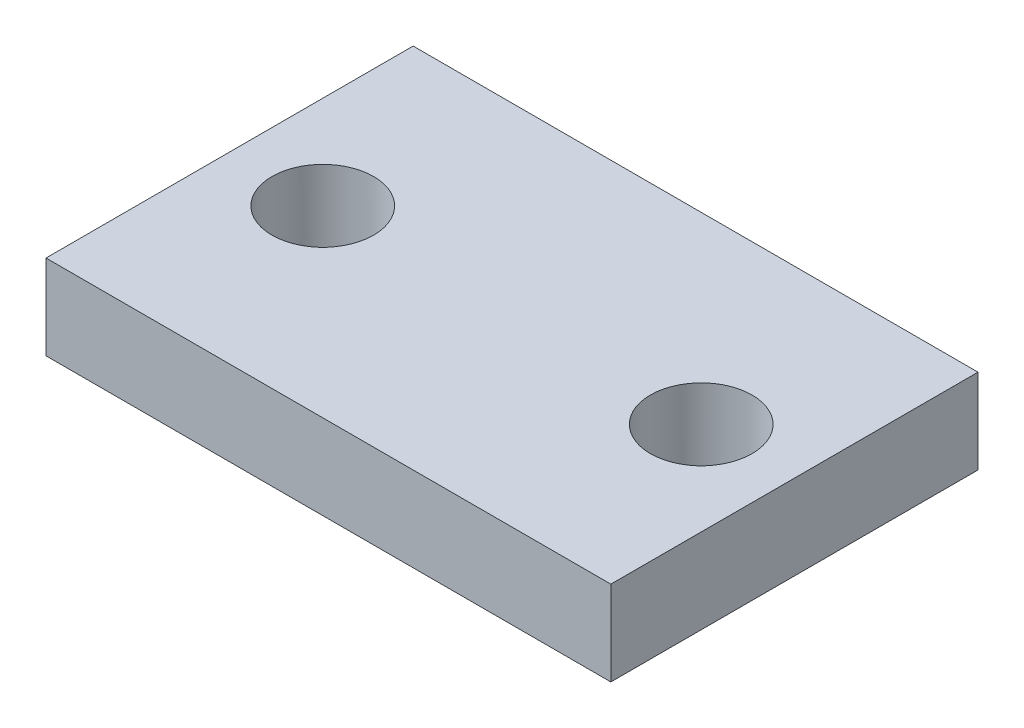
ISO-10303-21;
HEADER;
FILE_DESCRIPTION(('STEP AP214'),'2;1');
FILE_NAME('part.step','',(''),(''),'','','');
FILE_SCHEMA(('AUTOMOTIVE_DESIGN { 1 0 10303 214 1 1 1 1 }'));
ENDSEC;
DATA;
#1=APPLICATION_CONTEXT('core data for automotive mechanical design processes');
#2=APPLICATION_PROTOCOL_DEFINITION('international standard','automotive_design',2000,#1);
#3=PRODUCT_CONTEXT('',#1,'mechanical');
#4=PRODUCT('Part','Part','',(#3));
#5=PRODUCT_RELATED_PRODUCT_CATEGORY('part','',(#4));
#6=PRODUCT_DEFINITION_FORMATION('','',#4);
#7=PRODUCT_DEFINITION_CONTEXT('part definition',#1,'design');
#8=PRODUCT_DEFINITION('design','',#6,#7);
#9=PRODUCT_DEFINITION_SHAPE('','',#8);
#10=(LENGTH_UNIT() NAMED_UNIT(*) SI_UNIT(.MILLI.,.METRE.));
#11=(NAMED_UNIT(*) PLANE_ANGLE_UNIT() SI_UNIT($,.RADIAN.));
#12=(NAMED_UNIT(*) SI_UNIT($,.STERADIAN.) SOLID_ANGLE_UNIT());
#13=UNCERTAINTY_MEASURE_WITH_UNIT(LENGTH_MEASURE(1.E-05),#10,'distance_accuracy_value','');
#14=(GEOMETRIC_REPRESENTATION_CONTEXT(3) GLOBAL_UNCERTAINTY_ASSIGNED_CONTEXT((#13)) GLOBAL_UNIT_ASSIGNED_CONTEXT((#10,
#11,#12)) REPRESENTATION_CONTEXT('',''));
#15=CARTESIAN_POINT('',(0.,0.,0.));
#16=DIRECTION('',(0.,0.,1.));
#17=DIRECTION('',(1.,0.,0.));
#18=AXIS2_PLACEMENT_3D('',#15,#16,#17);
#19=CARTESIAN_POINT('',(0.,3.,0.));
#20=DIRECTION('',(1.,0.,0.));
#21=DIRECTION('',(0.,0.,-1.));
#22=AXIS2_PLACEMENT_3D('',#19,#20,#21);
#23=PLANE('',#22);
#24=DIRECTION('',(0.,0.,1.));
#25=VECTOR('',#24,1.);
#26=CARTESIAN_POINT('',(0.,0.,0.));
#27=LINE('',#26,#25);
#28=CARTESIAN_POINT('',(0.,0.,-13.));
#29=VERTEX_POINT('',#28);
#30=CARTESIAN_POINT('',(0.,0.,0.));
#31=VERTEX_POINT('',#30);
#32=EDGE_CURVE('E102',#29,#31,#27,.T.);
#33=ORIENTED_EDGE('',*,*,#32,.T.);
#34=DIRECTION('',(0.,-1.,0.));
#35=VECTOR('',#34,1.);
#36=CARTESIAN_POINT('',(0.,3.,0.));
#37=LINE('',#36,#35);
#38=CARTESIAN_POINT('',(0.,3.,0.));
#39=VERTEX_POINT('',#38);
#40=EDGE_CURVE('E11',#39,#31,#37,.T.);
#41=ORIENTED_EDGE('',*,*,#40,.F.);
#42=DIRECTION('',(0.,0.,1.));
#43=VECTOR('',#42,1.);
#44=CARTESIAN_POINT('',(0.,3.,0.));
#45=LINE('',#44,#43);
#46=CARTESIAN_POINT('',(0.,3.,-13.));
#47=VERTEX_POINT('',#46);
#48=EDGE_CURVE('E90',#47,#39,#45,.T.);
#49=ORIENTED_EDGE('',*,*,#48,.F.);
#50=DIRECTION('',(0.,-1.,0.));
#51=VECTOR('',#50,1.);
#52=CARTESIAN_POINT('',(0.,3.,-13.));
#53=LINE('',#52,#51);
#54=EDGE_CURVE('E98',#47,#29,#53,.T.);
#55=ORIENTED_EDGE('',*,*,#54,.T.);
#56=EDGE_LOOP('',(#33,#41,#49,#55));
#57=FACE_BOUND('',#56,.T.);
#58=ADVANCED_FACE('F39',(#57),#23,.F.);
#59=CARTESIAN_POINT('',(0.,3.,0.));
#60=DIRECTION('',(0.,0.,-1.));
#61=DIRECTION('',(-1.,0.,0.));
#62=AXIS2_PLACEMENT_3D('',#59,#60,#61);
#63=PLANE('',#62);
#64=DIRECTION('',(1.,0.,0.));
#65=VECTOR('',#64,1.);
#66=CARTESIAN_POINT('',(0.,0.,0.));
#67=LINE('',#66,#65);
#68=CARTESIAN_POINT('',(20.,0.,0.));
#69=VERTEX_POINT('',#68);
#70=EDGE_CURVE('E94',#31,#69,#67,.T.);
#71=ORIENTED_EDGE('',*,*,#70,.T.);
#72=DIRECTION('',(0.,-1.,0.));
#73=VECTOR('',#72,1.);
#74=CARTESIAN_POINT('',(20.,3.,0.));
#75=LINE('',#74,#73);
#76=CARTESIAN_POINT('',(20.,3.,0.));
#77=VERTEX_POINT('',#76);
#78=EDGE_CURVE('E47',#77,#69,#75,.T.);
#79=ORIENTED_EDGE('',*,*,#78,.F.);
#80=DIRECTION('',(1.,0.,0.));
#81=VECTOR('',#80,1.);
#82=CARTESIAN_POINT('',(0.,3.,0.));
#83=LINE('',#82,#81);
#84=EDGE_CURVE('E85',#39,#77,#83,.T.);
#85=ORIENTED_EDGE('',*,*,#84,.F.);
#86=ORIENTED_EDGE('',*,*,#40,.T.);
#87=EDGE_LOOP('',(#71,#79,#85,#86));
#88=FACE_BOUND('',#87,.T.);
#89=ADVANCED_FACE('F93',(#88),#63,.F.);
#90=CARTESIAN_POINT('',(20.,3.,0.));
#91=DIRECTION('',(-1.,0.,0.));
#92=DIRECTION('',(0.,0.,1.));
#93=AXIS2_PLACEMENT_3D('',#90,#91,#92);
#94=PLANE('',#93);
#95=DIRECTION('',(0.,0.,-1.));
#96=VECTOR('',#95,1.);
#97=CARTESIAN_POINT('',(20.,0.,0.));
#98=LINE('',#97,#96);
#99=CARTESIAN_POINT('',(20.,0.,-13.));
#100=VERTEX_POINT('',#99);
#101=EDGE_CURVE('E72',#69,#100,#98,.T.);
#102=ORIENTED_EDGE('',*,*,#101,.T.);
#103=DIRECTION('',(0.,-1.,0.));
#104=VECTOR('',#103,1.);
#105=CARTESIAN_POINT('',(20.,3.,-13.));
#106=LINE('',#105,#104);
#107=CARTESIAN_POINT('',(20.,3.,-13.));
#108=VERTEX_POINT('',#107);
#109=EDGE_CURVE('E95',#108,#100,#106,.T.);
#110=ORIENTED_EDGE('',*,*,#109,.F.);
#111=DIRECTION('',(0.,0.,-1.));
#112=VECTOR('',#111,1.);
#113=CARTESIAN_POINT('',(20.,3.,0.));
#114=LINE('',#113,#112);
#115=EDGE_CURVE('E88',#77,#108,#114,.T.);
#116=ORIENTED_EDGE('',*,*,#115,.F.);
#117=ORIENTED_EDGE('',*,*,#78,.T.);
#118=EDGE_LOOP('',(#102,#110,#116,#117));
#119=FACE_BOUND('',#118,.T.);
#120=ADVANCED_FACE('F96',(#119),#94,.F.);
#121=CARTESIAN_POINT('',(0.,3.,-13.));
#122=DIRECTION('',(0.,0.,1.));
#123=DIRECTION('',(1.,0.,0.));
#124=AXIS2_PLACEMENT_3D('',#121,#122,#123);
#125=PLANE('',#124);
#126=DIRECTION('',(-1.,0.,0.));
#127=VECTOR('',#126,1.);
#128=CARTESIAN_POINT('',(0.,0.,-13.));
#129=LINE('',#128,#127);
#130=EDGE_CURVE('E78',#100,#29,#129,.T.);
#131=ORIENTED_EDGE('',*,*,#130,.T.);
#132=ORIENTED_EDGE('',*,*,#54,.F.);
#133=DIRECTION('',(-1.,0.,0.));
#134=VECTOR('',#133,1.);
#135=CARTESIAN_POINT('',(0.,3.,-13.));
#136=LINE('',#135,#134);
#137=EDGE_CURVE('E55',#108,#47,#136,.T.);
#138=ORIENTED_EDGE('',*,*,#137,.F.);
#139=ORIENTED_EDGE('',*,*,#109,.T.);
#140=EDGE_LOOP('',(#131,#132,#138,#139));
#141=FACE_BOUND('',#140,.T.);
#142=ADVANCED_FACE('F110',(#141),#125,.F.);
#143=CARTESIAN_POINT('',(0.,3.,0.));
#144=DIRECTION('',(0.,-1.,0.));
#145=DIRECTION('',(0.,0.,-1.));
#146=AXIS2_PLACEMENT_3D('',#143,#144,#145);
#147=PLANE('',#146);
#148=CARTESIAN_POINT('',(3.3,3.,-6.50000000000001));
#149=DIRECTION('',(0.,-1.,0.));
#150=DIRECTION('',(0.,0.,-1.));
#151=AXIS2_PLACEMENT_3D('',#148,#149,#150);
#152=CIRCLE('',#151,1.8);
#153=CARTESIAN_POINT('',(3.3,3.,-8.30000000000001));
#154=VERTEX_POINT('',#153);
#155=EDGE_CURVE('E105',#154,#154,#152,.T.);
#156=ORIENTED_EDGE('',*,*,#155,.T.);
#157=EDGE_LOOP('',(#156));
#158=FACE_BOUND('',#157,.T.);
#159=CARTESIAN_POINT('',(16.7,3.,-6.50000000000001));
#160=DIRECTION('',(0.,-1.,0.));
#161=DIRECTION('',(0.,0.,-1.));
#162=AXIS2_PLACEMENT_3D('',#159,#160,#161);
#163=CIRCLE('',#162,1.8);
#164=CARTESIAN_POINT('',(16.7,3.,-8.30000000000001));
#165=VERTEX_POINT('',#164);
#166=EDGE_CURVE('E118',#165,#165,#163,.T.);
#167=ORIENTED_EDGE('',*,*,#166,.T.);
#168=EDGE_LOOP('',(#167));
#169=FACE_BOUND('',#168,.T.);
#170=ORIENTED_EDGE('',*,*,#48,.T.);
#171=ORIENTED_EDGE('',*,*,#84,.T.);
#172=ORIENTED_EDGE('',*,*,#115,.T.);
#173=ORIENTED_EDGE('',*,*,#137,.T.);
#174=EDGE_LOOP('',(#170,#171,#172,#173));
#175=FACE_BOUND('',#174,.T.);
#176=ADVANCED_FACE('F86',(#158,#169,#175),#147,.F.);
#177=CARTESIAN_POINT('',(0.,0.,0.));
#178=DIRECTION('',(0.,-1.,0.));
#179=DIRECTION('',(0.,0.,-1.));
#180=AXIS2_PLACEMENT_3D('',#177,#178,#179);
#181=PLANE('',#180);
#182=CARTESIAN_POINT('',(3.3,0.,-6.50000000000001));
#183=DIRECTION('',(0.,1.,0.));
#184=DIRECTION('',(0.,0.,1.));
#185=AXIS2_PLACEMENT_3D('',#182,#183,#184);
#186=CIRCLE('',#185,1.8);
#187=CARTESIAN_POINT('',(3.3,0.,-4.7));
#188=VERTEX_POINT('',#187);
#189=EDGE_CURVE('E121',#188,#188,#186,.T.);
#190=ORIENTED_EDGE('',*,*,#189,.T.);
#191=EDGE_LOOP('',(#190));
#192=FACE_BOUND('',#191,.T.);
#193=CARTESIAN_POINT('',(16.7,0.,-6.50000000000001));
#194=DIRECTION('',(0.,1.,0.));
#195=DIRECTION('',(0.,0.,1.));
#196=AXIS2_PLACEMENT_3D('',#193,#194,#195);
#197=CIRCLE('',#196,1.8);
#198=CARTESIAN_POINT('',(16.7,0.,-4.70000000000001));
#199=VERTEX_POINT('',#198);
#200=EDGE_CURVE('E122',#199,#199,#197,.T.);
#201=ORIENTED_EDGE('',*,*,#200,.T.);
#202=EDGE_LOOP('',(#201));
#203=FACE_BOUND('',#202,.T.);
#204=ORIENTED_EDGE('',*,*,#32,.F.);
#205=ORIENTED_EDGE('',*,*,#130,.F.);
#206=ORIENTED_EDGE('',*,*,#101,.F.);
#207=ORIENTED_EDGE('',*,*,#70,.F.);
#208=EDGE_LOOP('',(#204,#205,#206,#207));
#209=FACE_BOUND('',#208,.T.);
#210=ADVANCED_FACE('F113',(#192,#203,#209),#181,.T.);
#211=CARTESIAN_POINT('',(16.7,0.,-6.50000000000001));
#212=DIRECTION('',(0.,1.,0.));
#213=DIRECTION('',(0.,0.,1.));
#214=AXIS2_PLACEMENT_3D('',#211,#212,#213);
#215=CYLINDRICAL_SURFACE('',#214,1.8);
#216=ORIENTED_EDGE('',*,*,#200,.F.);
#217=EDGE_LOOP('',(#216));
#218=FACE_BOUND('',#217,.T.);
#219=ORIENTED_EDGE('',*,*,#166,.F.);
#220=EDGE_LOOP('',(#219));
#221=FACE_BOUND('',#220,.T.);
#222=ADVANCED_FACE('F133',(#218,#221),#215,.F.);
#223=CARTESIAN_POINT('',(3.3,0.,-6.50000000000001));
#224=DIRECTION('',(0.,1.,0.));
#225=DIRECTION('',(0.,0.,1.));
#226=AXIS2_PLACEMENT_3D('',#223,#224,#225);
#227=CYLINDRICAL_SURFACE('',#226,1.8);
#228=ORIENTED_EDGE('',*,*,#189,.F.);
#229=EDGE_LOOP('',(#228));
#230=FACE_BOUND('',#229,.T.);
#231=ORIENTED_EDGE('',*,*,#155,.F.);
#232=EDGE_LOOP('',(#231));
#233=FACE_BOUND('',#232,.T.);
#234=ADVANCED_FACE('F130',(#230,#233),#227,.F.);
#235=CLOSED_SHELL('',(#58,#89,#120,#142,#176,#210,#222,#234));
#236=MANIFOLD_SOLID_BREP('B2',#235);
#237=ADVANCED_BREP_SHAPE_REPRESENTATION('',(#18,#236),#14);
#238=SHAPE_DEFINITION_REPRESENTATION(#9,#237);
ENDSEC;
END-ISO-10303-21;
